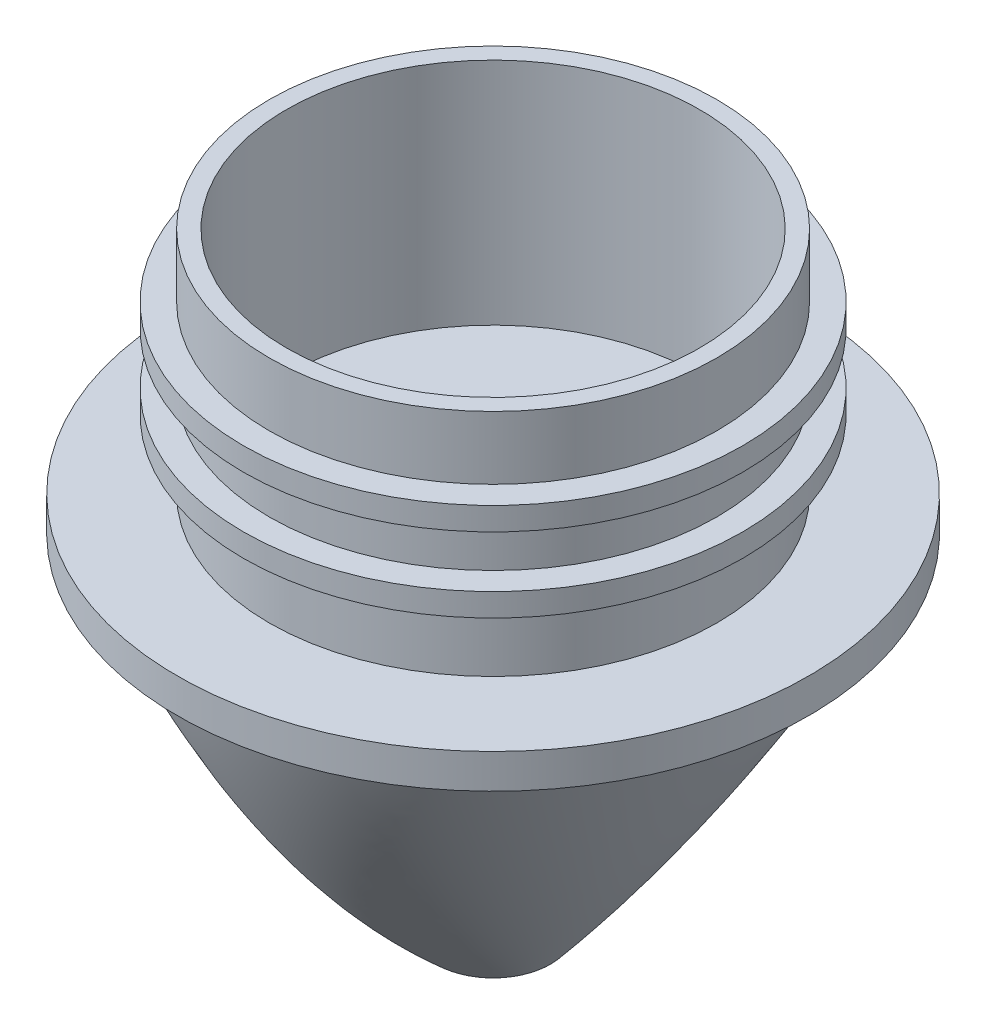
ISO-10303-21;
HEADER;
FILE_DESCRIPTION(('STEP AP214'),'2;1');
FILE_NAME('part.step','',(''),(''),'','','');
FILE_SCHEMA(('AUTOMOTIVE_DESIGN { 1 0 10303 214 1 1 1 1 }'));
ENDSEC;
DATA;
#1=APPLICATION_CONTEXT('core data for automotive mechanical design processes');
#2=APPLICATION_PROTOCOL_DEFINITION('international standard','automotive_design',2000,#1);
#3=PRODUCT_CONTEXT('',#1,'mechanical');
#4=PRODUCT('Part','Part','',(#3));
#5=PRODUCT_RELATED_PRODUCT_CATEGORY('part','',(#4));
#6=PRODUCT_DEFINITION_FORMATION('','',#4);
#7=PRODUCT_DEFINITION_CONTEXT('part definition',#1,'design');
#8=PRODUCT_DEFINITION('design','',#6,#7);
#9=PRODUCT_DEFINITION_SHAPE('','',#8);
#10=(LENGTH_UNIT() NAMED_UNIT(*) SI_UNIT(.MILLI.,.METRE.));
#11=(NAMED_UNIT(*) PLANE_ANGLE_UNIT() SI_UNIT($,.RADIAN.));
#12=(NAMED_UNIT(*) SI_UNIT($,.STERADIAN.) SOLID_ANGLE_UNIT());
#13=UNCERTAINTY_MEASURE_WITH_UNIT(LENGTH_MEASURE(1.E-05),#10,'distance_accuracy_value','');
#14=(GEOMETRIC_REPRESENTATION_CONTEXT(3) GLOBAL_UNCERTAINTY_ASSIGNED_CONTEXT((#13)) GLOBAL_UNIT_ASSIGNED_CONTEXT((#10,
#11,#12)) REPRESENTATION_CONTEXT('',''));
#15=CARTESIAN_POINT('',(0.,0.,0.));
#16=DIRECTION('',(0.,0.,1.));
#17=DIRECTION('',(1.,0.,0.));
#18=AXIS2_PLACEMENT_3D('',#15,#16,#17);
#19=CARTESIAN_POINT('',(0.,-23.4034123059416,-1.68146346259813));
#20=DIRECTION('',(-1.,0.,0.));
#21=DIRECTION('',(0.,0.,1.));
#22=AXIS2_PLACEMENT_3D('',#19,#20,#21);
#23=CIRCLE('',#22,11.6934361661484);
#24=TRIMMED_CURVE('',#23,(PARAMETER_VALUE(-1.42650061481023)),
(PARAMETER_VALUE(1.42650061481023)),.T.,.PARAMETER.);
#25=CARTESIAN_POINT('',(0.,-23.4034123059416,0.));
#26=DIRECTION('',(0.,1.,0.));
#27=AXIS1_PLACEMENT('',#25,#26);
#28=SURFACE_OF_REVOLUTION('',#24,#27);
#29=CARTESIAN_POINT('',(0.,-34.9753235567132,0.));
#30=VERTEX_POINT('',#29);
#31=VERTEX_LOOP('',#30);
#32=FACE_BOUND('',#31,.T.);
#33=CARTESIAN_POINT('',(0.,-33.,0.));
#34=DIRECTION('',(0.,1.,0.));
#35=DIRECTION('',(0.,0.,1.));
#36=AXIS2_PLACEMENT_3D('',#33,#34,#35);
#37=CIRCLE('',#36,5.);
#38=CARTESIAN_POINT('',(0.,-33.,5.));
#39=VERTEX_POINT('',#38);
#40=EDGE_CURVE('E14',#39,#39,#37,.T.);
#41=ORIENTED_EDGE('',*,*,#40,.F.);
#42=EDGE_LOOP('',(#41));
#43=FACE_BOUND('',#42,.T.);
#44=ADVANCED_FACE('F96',(#32,#43),#28,.T.);
#45=CARTESIAN_POINT('',(0.,-33.,5.));
#46=DIRECTION('',(0.,1.,0.));
#47=DIRECTION('',(0.,0.,1.));
#48=AXIS2_PLACEMENT_3D('',#45,#46,#47);
#49=PLANE('',#48);
#50=ORIENTED_EDGE('',*,*,#40,.T.);
#51=EDGE_LOOP('',(#50));
#52=FACE_BOUND('',#51,.T.);
#53=ADVANCED_FACE('F105',(#52),#49,.T.);
#54=CLOSED_SHELL('',(#44,#53));
#55=MANIFOLD_SOLID_BREP('B2',#54);
#56=CARTESIAN_POINT('',(0.,-33.,-5.));
#57=DIRECTION('',(0.,1.,-1.06741180562796E-13));
#58=DIRECTION('',(0.,1.06741180562796E-13,1.));
#59=AXIS2_PLACEMENT_3D('',#56,#57,#58);
#60=PLANE('',#59);
#61=CARTESIAN_POINT('',(0.,-33.,5.));
#62=CARTESIAN_POINT('',(-0.327249232137514,-33.,5.));
#63=CARTESIAN_POINT('',(-0.981680403977716,-33.,4.93499328124983));
#64=CARTESIAN_POINT('',(-2.24064053377986,-33.,4.55458579852169));
#65=CARTESIAN_POINT('',(-3.62771208725025,-32.9999999999999,3.62764916613364));
#66=CARTESIAN_POINT('',(-4.73979573179852,-33.,1.9633506312621));
#67=CARTESIAN_POINT('',(-5.13036592541444,-32.9999999999999,0.));
#68=CARTESIAN_POINT('',(-4.73979573179851,-33.0000000000001,-1.9633506312621));
#69=CARTESIAN_POINT('',(-3.62771208725026,-32.9999999999999,-3.62764916613364));
#70=CARTESIAN_POINT('',(-2.24064053377986,-33.,-4.55458579852169));
#71=CARTESIAN_POINT('',(-0.981680403977716,-33.,-4.93499328124983));
#72=CARTESIAN_POINT('',(-0.327249232137514,-33.,-5.));
#73=CARTESIAN_POINT('',(0.327249232137514,-33.,-5.));
#74=CARTESIAN_POINT('',(0.981680403977717,-33.,-4.93499328124983));
#75=CARTESIAN_POINT('',(2.24064053377986,-33.,-4.5545857985217));
#76=CARTESIAN_POINT('',(3.62771208725025,-32.9999999999999,-3.62764916613363));
#77=CARTESIAN_POINT('',(4.73979573179853,-33.,-1.9633506312621));
#78=CARTESIAN_POINT('',(5.13036592541442,-33.,0.));
#79=CARTESIAN_POINT('',(4.73979573179853,-33.,1.9633506312621));
#80=CARTESIAN_POINT('',(3.62771208725025,-33.,3.62764916613364));
#81=CARTESIAN_POINT('',(2.24064053377986,-33.,4.55458579852169));
#82=CARTESIAN_POINT('',(0.981680403977717,-33.,4.93499328124983));
#83=CARTESIAN_POINT('',(0.327249232137515,-33.,5.));
#84=CARTESIAN_POINT('',(0.,-33.,5.));
#85=B_SPLINE_CURVE_WITH_KNOTS('',3,(#61,#62,#63,#64,#65,#66,#67,#68,#69,#70,#71,#72,#73,#74,#75,
#76,#77,#78,#79,#80,#81,#82,#83,#84),.UNSPECIFIED.,.T.,.F.,(4,1,1,1,1,1,1,1,1,1,2,1,1,1,1,1,1,1,
1,1,4),(0.,0.03125,0.0625,0.125,0.1875,0.25,0.3125,0.375,0.4375,0.46875,0.5,0.53125,0.5625,
0.625,0.6875,0.75,0.8125,0.875,0.9375,0.96875,1.),.UNSPECIFIED.);
#86=CARTESIAN_POINT('',(0.,-33.,5.));
#87=VERTEX_POINT('',#86);
#88=EDGE_CURVE('E134',#87,#87,#85,.F.);
#89=ORIENTED_EDGE('',*,*,#88,.F.);
#90=EDGE_LOOP('',(#89));
#91=FACE_BOUND('',#90,.T.);
#92=ADVANCED_FACE('F131',(#91),#60,.F.);
#93=CARTESIAN_POINT('',(0.,-3.,-25.));
#94=DIRECTION('',(0.,1.,0.));
#95=DIRECTION('',(0.,0.,1.));
#96=AXIS2_PLACEMENT_3D('',#93,#94,#95);
#97=PLANE('',#96);
#98=CARTESIAN_POINT('',(0.,-3.,25.));
#99=CARTESIAN_POINT('',(-1.63624616068757,-3.,25.));
#100=CARTESIAN_POINT('',(-4.90813549192513,-3.,24.6765838751217));
#101=CARTESIAN_POINT('',(-11.2035179919908,-2.99999999999999,22.7715638139233));
#102=CARTESIAN_POINT('',(-18.1384091942729,-3.00000000000001,18.1389749409526));
#103=CARTESIAN_POINT('',(-23.6992576262852,-3.,9.81635374424561));
#104=CARTESIAN_POINT('',(-25.6515460302529,-2.99999999999999,0.));
#105=CARTESIAN_POINT('',(-23.6992576262853,-3.00000000000001,-9.81635374424557));
#106=CARTESIAN_POINT('',(-18.1384091942729,-3.,-18.1389749409527));
#107=CARTESIAN_POINT('',(-11.2035179919908,-3.,-22.7715638139232));
#108=CARTESIAN_POINT('',(-4.90813549192511,-3.,-24.6765838751217));
#109=CARTESIAN_POINT('',(-1.63624616068757,-3.,-25.));
#110=CARTESIAN_POINT('',(1.63624616068757,-3.,-25.));
#111=CARTESIAN_POINT('',(4.90813549192511,-3.,-24.6765838751217));
#112=CARTESIAN_POINT('',(11.2035179919908,-3.,-22.7715638139232));
#113=CARTESIAN_POINT('',(18.1384091942728,-3.,-18.1389749409527));
#114=CARTESIAN_POINT('',(23.6992576262853,-3.00000000000001,-9.81635374424558));
#115=CARTESIAN_POINT('',(25.6515460302528,-2.99999999999999,0.));
#116=CARTESIAN_POINT('',(23.6992576262852,-3.00000000000001,9.81635374424565));
#117=CARTESIAN_POINT('',(18.1384091942729,-3.,18.1389749409526));
#118=CARTESIAN_POINT('',(11.2035179919908,-3.00000000000001,22.7715638139233));
#119=CARTESIAN_POINT('',(4.90813549192513,-3.,24.6765838751217));
#120=CARTESIAN_POINT('',(1.63624616068757,-3.,25.));
#121=CARTESIAN_POINT('',(0.,-3.,25.));
#122=B_SPLINE_CURVE_WITH_KNOTS('',3,(#98,#99,#100,#101,#102,#103,#104,#105,#106,#107,#108,#109,
#110,#111,#112,#113,#114,#115,#116,#117,#118,#119,#120,#121),.UNSPECIFIED.,.T.,.F.,(4,1,1,1,1,1,
1,1,1,1,2,1,1,1,1,1,1,1,1,1,4),(0.,0.03125,0.0625,0.125,0.1875,0.25,0.3125,0.375,0.4375,0.46875,
0.5,0.53125,0.5625,0.625,0.6875,0.75,0.8125,0.875,0.9375,0.96875,1.),.UNSPECIFIED.);
#123=CARTESIAN_POINT('',(0.,-3.,25.));
#124=VERTEX_POINT('',#123);
#125=EDGE_CURVE('E95',#124,#124,#122,.T.);
#126=ORIENTED_EDGE('',*,*,#125,.F.);
#127=EDGE_LOOP('',(#126));
#128=FACE_BOUND('',#127,.T.);
#129=ADVANCED_FACE('F161',(#128),#97,.T.);
#130=CARTESIAN_POINT('',(0.,-3.,25.));
#131=CARTESIAN_POINT('',(0.,-14.5667957946294,21.0517209178654));
#132=CARTESIAN_POINT('',(0.,-24.9066670800951,14.1584733942216));
#133=CARTESIAN_POINT('',(0.,-33.,5.));
#134=CARTESIAN_POINT('',(-1.63624616068757,-3.,25.));
#135=CARTESIAN_POINT('',(-1.19991385117089,-14.5667957946294,21.0517209178654));
#136=CARTESIAN_POINT('',(-0.7635815416542,-24.9066670800951,14.1584733942216));
#137=CARTESIAN_POINT('',(-0.327249232137514,-33.,5.));
#138=CARTESIAN_POINT('',(-4.90813549192513,-3.,24.6765838751217));
#139=CARTESIAN_POINT('',(-3.59931712927599,-14.5667957946294,20.7719664556881));
#140=CARTESIAN_POINT('',(-2.29049876662685,-24.9066670800951,13.968395726644));
#141=CARTESIAN_POINT('',(-0.981680403977716,-33.,4.93499328124983));
#142=CARTESIAN_POINT('',(-11.2035179919908,-2.99999999999999,22.7715638139233));
#143=CARTESIAN_POINT('',(-8.21589217258713,-14.5667957946294,19.1415391542674));
#144=CARTESIAN_POINT('',(-5.2282663531835,-24.9066670800951,12.8656444104432));
#145=CARTESIAN_POINT('',(-2.24064053377986,-33.,4.55458579852169));
#146=CARTESIAN_POINT('',(-18.1384091942729,-3.00000000000001,18.1389749409526));
#147=CARTESIAN_POINT('',(-13.3015101585987,-14.5667957946294,15.2132326197204));
#148=CARTESIAN_POINT('',(-8.46461112292447,-24.906667080095,10.216809363052));
#149=CARTESIAN_POINT('',(-3.62771208725025,-32.9999999999999,3.62764916613364));
#150=CARTESIAN_POINT('',(-23.6992576262852,-3.,9.81635374424561));
#151=CARTESIAN_POINT('',(-17.3794369947897,-14.5667957946294,8.21808138411729));
#152=CARTESIAN_POINT('',(-11.0596163632941,-24.9066670800951,5.51544585842304));
#153=CARTESIAN_POINT('',(-4.73979573179852,-33.,1.9633506312621));
#154=CARTESIAN_POINT('',(-25.6515460302529,-2.99999999999999,0.));
#155=CARTESIAN_POINT('',(-18.8111526619734,-14.5667957946294,0.));
#156=CARTESIAN_POINT('',(-11.9707592936939,-24.906667080095,0.));
#157=CARTESIAN_POINT('',(-5.13036592541444,-32.9999999999999,0.));
#158=CARTESIAN_POINT('',(-23.6992576262853,-3.00000000000001,-9.81635374424557));
#159=CARTESIAN_POINT('',(-17.3794369947897,-14.5667957946295,-8.21808138411725));
#160=CARTESIAN_POINT('',(-11.0596163632941,-24.9066670800951,-5.51544585842303));
#161=CARTESIAN_POINT('',(-4.73979573179851,-33.0000000000001,-1.9633506312621));
#162=CARTESIAN_POINT('',(-18.1384091942729,-3.,-18.1389749409527));
#163=CARTESIAN_POINT('',(-13.3015101585987,-14.5667957946294,-15.2132326197204));
#164=CARTESIAN_POINT('',(-8.46461112292446,-24.906667080095,-10.2168093630521));
#165=CARTESIAN_POINT('',(-3.62771208725026,-32.9999999999999,-3.62764916613364));
#166=CARTESIAN_POINT('',(-11.2035179919908,-3.,-22.7715638139232));
#167=CARTESIAN_POINT('',(-8.21589217258715,-14.5667957946294,-19.1415391542674));
#168=CARTESIAN_POINT('',(-5.2282663531835,-24.9066670800951,-12.8656444104432));
#169=CARTESIAN_POINT('',(-2.24064053377986,-33.,-4.55458579852169));
#170=CARTESIAN_POINT('',(-4.90813549192511,-3.,-24.6765838751217));
#171=CARTESIAN_POINT('',(-3.59931712927598,-14.5667957946294,-20.7719664556881));
#172=CARTESIAN_POINT('',(-2.29049876662685,-24.9066670800951,-13.968395726644));
#173=CARTESIAN_POINT('',(-0.981680403977716,-33.,-4.93499328124983));
#174=CARTESIAN_POINT('',(-1.63624616068757,-3.,-25.));
#175=CARTESIAN_POINT('',(-1.19991385117089,-14.5667957946294,-21.0517209178653));
#176=CARTESIAN_POINT('',(-0.7635815416542,-24.9066670800951,-14.1584733942216));
#177=CARTESIAN_POINT('',(-0.327249232137514,-33.,-5.));
#178=CARTESIAN_POINT('',(1.63624616068757,-3.,-25.));
#179=CARTESIAN_POINT('',(1.19991385117089,-14.5667957946294,-21.0517209178653));
#180=CARTESIAN_POINT('',(0.7635815416542,-24.9066670800951,-14.1584733942216));
#181=CARTESIAN_POINT('',(0.327249232137514,-33.,-5.));
#182=CARTESIAN_POINT('',(4.90813549192511,-3.,-24.6765838751217));
#183=CARTESIAN_POINT('',(3.59931712927598,-14.5667957946294,-20.7719664556881));
#184=CARTESIAN_POINT('',(2.29049876662685,-24.9066670800951,-13.968395726644));
#185=CARTESIAN_POINT('',(0.981680403977717,-33.,-4.93499328124983));
#186=CARTESIAN_POINT('',(11.2035179919908,-3.,-22.7715638139232));
#187=CARTESIAN_POINT('',(8.21589217258716,-14.5667957946294,-19.1415391542674));
#188=CARTESIAN_POINT('',(5.22826635318351,-24.9066670800951,-12.8656444104432));
#189=CARTESIAN_POINT('',(2.24064053377986,-33.,-4.5545857985217));
#190=CARTESIAN_POINT('',(18.1384091942728,-3.,-18.1389749409527));
#191=CARTESIAN_POINT('',(13.3015101585986,-14.5667957946294,-15.2132326197204));
#192=CARTESIAN_POINT('',(8.46461112292443,-24.906667080095,-10.2168093630521));
#193=CARTESIAN_POINT('',(3.62771208725025,-32.9999999999999,-3.62764916613363));
#194=CARTESIAN_POINT('',(23.6992576262853,-3.00000000000001,-9.81635374424558));
#195=CARTESIAN_POINT('',(17.3794369947897,-14.5667957946294,-8.21808138411725));
#196=CARTESIAN_POINT('',(11.0596163632941,-24.9066670800951,-5.51544585842303));
#197=CARTESIAN_POINT('',(4.73979573179853,-33.,-1.9633506312621));
#198=CARTESIAN_POINT('',(25.6515460302528,-2.99999999999999,0.));
#199=CARTESIAN_POINT('',(18.8111526619734,-14.5667957946294,0.));
#200=CARTESIAN_POINT('',(11.9707592936939,-24.9066670800951,0.));
#201=CARTESIAN_POINT('',(5.13036592541442,-33.,0.));
#202=CARTESIAN_POINT('',(23.6992576262852,-3.00000000000001,9.81635374424565));
#203=CARTESIAN_POINT('',(17.3794369947897,-14.5667957946295,8.21808138411732));
#204=CARTESIAN_POINT('',(11.0596163632941,-24.9066670800951,5.51544585842305));
#205=CARTESIAN_POINT('',(4.73979573179853,-33.,1.9633506312621));
#206=CARTESIAN_POINT('',(18.1384091942729,-3.,18.1389749409526));
#207=CARTESIAN_POINT('',(13.3015101585987,-14.5667957946294,15.2132326197203));
#208=CARTESIAN_POINT('',(8.46461112292447,-24.9066670800951,10.216809363052));
#209=CARTESIAN_POINT('',(3.62771208725025,-33.,3.62764916613364));
#210=CARTESIAN_POINT('',(11.2035179919908,-3.00000000000001,22.7715638139233));
#211=CARTESIAN_POINT('',(8.21589217258715,-14.5667957946294,19.1415391542674));
#212=CARTESIAN_POINT('',(5.2282663531835,-24.9066670800951,12.8656444104432));
#213=CARTESIAN_POINT('',(2.24064053377986,-33.,4.55458579852169));
#214=CARTESIAN_POINT('',(4.90813549192513,-3.,24.6765838751217));
#215=CARTESIAN_POINT('',(3.59931712927599,-14.5667957946294,20.7719664556881));
#216=CARTESIAN_POINT('',(2.29049876662685,-24.9066670800951,13.968395726644));
#217=CARTESIAN_POINT('',(0.981680403977717,-33.,4.93499328124983));
#218=CARTESIAN_POINT('',(1.63624616068757,-3.,25.));
#219=CARTESIAN_POINT('',(1.19991385117089,-14.5667957946294,21.0517209178654));
#220=CARTESIAN_POINT('',(0.7635815416542,-24.9066670800951,14.1584733942216));
#221=CARTESIAN_POINT('',(0.327249232137515,-33.,5.));
#222=CARTESIAN_POINT('',(0.,-3.,25.));
#223=CARTESIAN_POINT('',(0.,-14.5667957946294,21.0517209178654));
#224=CARTESIAN_POINT('',(0.,-24.9066670800951,14.1584733942216));
#225=CARTESIAN_POINT('',(0.,-33.,5.));
#226=B_SPLINE_SURFACE_WITH_KNOTS('',3,3,((#130,#131,#132,#133),(#134,#135,#136,#137),(#138,#139,
#140,#141),(#142,#143,#144,#145),(#146,#147,#148,#149),(#150,#151,#152,#153),(#154,#155,#156,
#157),(#158,#159,#160,#161),(#162,#163,#164,#165),(#166,#167,#168,#169),(#170,#171,#172,#173),
(#174,#175,#176,#177),(#178,#179,#180,#181),(#182,#183,#184,#185),(#186,#187,#188,#189),(#190,
#191,#192,#193),(#194,#195,#196,#197),(#198,#199,#200,#201),(#202,#203,#204,#205),(#206,#207,
#208,#209),(#210,#211,#212,#213),(#214,#215,#216,#217),(#218,#219,#220,#221),(#222,#223,#224,
#225)),.UNSPECIFIED.,.T.,.F.,.F.,(4,1,1,1,1,1,1,1,1,1,2,1,1,1,1,1,1,1,1,1,4),(4,4),(0.,0.03125,
0.0625,0.125,0.1875,0.25,0.3125,0.375,0.4375,0.46875,0.5,0.53125,0.5625,0.625,0.6875,0.75,
0.8125,0.875,0.9375,0.96875,1.),(0.,1.),.UNSPECIFIED.);
#227=ORIENTED_EDGE('',*,*,#125,.T.);
#228=EDGE_LOOP('',(#227));
#229=FACE_BOUND('',#228,.T.);
#230=ORIENTED_EDGE('',*,*,#88,.T.);
#231=EDGE_LOOP('',(#230));
#232=FACE_BOUND('',#231,.T.);
#233=ADVANCED_FACE('F158',(#229,#232),#226,.T.);
#234=OPEN_SHELL('',(#92,#129,#233));
#235=SHELL_BASED_SURFACE_MODEL('B8',(#234));
#236=CARTESIAN_POINT('',(0.,0.,0.));
#237=DIRECTION('',(0.,-1.,0.));
#238=DIRECTION('',(0.,0.,-1.));
#239=AXIS2_PLACEMENT_3D('',#236,#237,#238);
#240=PLANE('',#239);
#241=CARTESIAN_POINT('',(0.,0.,0.));
#242=DIRECTION('',(0.,1.,0.));
#243=DIRECTION('',(0.,0.,1.));
#244=AXIS2_PLACEMENT_3D('',#241,#242,#243);
#245=CIRCLE('',#244,18.);
#246=CARTESIAN_POINT('',(0.,0.,18.));
#247=VERTEX_POINT('',#246);
#248=EDGE_CURVE('E254',#247,#247,#245,.T.);
#249=ORIENTED_EDGE('',*,*,#248,.T.);
#250=EDGE_LOOP('',(#249));
#251=FACE_BOUND('',#250,.T.);
#252=ADVANCED_FACE('F204',(#251),#240,.F.);
#253=CARTESIAN_POINT('',(0.,20.,0.));
#254=DIRECTION('',(0.,-1.,0.));
#255=DIRECTION('',(0.,0.,-1.));
#256=AXIS2_PLACEMENT_3D('',#253,#254,#255);
#257=CYLINDRICAL_SURFACE('',#256,19.5);
#258=CARTESIAN_POINT('',(0.,8.,0.));
#259=DIRECTION('',(0.,1.,0.));
#260=DIRECTION('',(0.,0.,1.));
#261=AXIS2_PLACEMENT_3D('',#258,#259,#260);
#262=CIRCLE('',#261,19.5);
#263=CARTESIAN_POINT('',(0.,8.,19.5));
#264=VERTEX_POINT('',#263);
#265=EDGE_CURVE('E235',#264,#264,#262,.T.);
#266=ORIENTED_EDGE('',*,*,#265,.T.);
#267=EDGE_LOOP('',(#266));
#268=FACE_BOUND('',#267,.T.);
#269=CARTESIAN_POINT('',(0.,12.5,0.));
#270=DIRECTION('',(0.,1.,0.));
#271=DIRECTION('',(0.,0.,1.));
#272=AXIS2_PLACEMENT_3D('',#269,#270,#271);
#273=CIRCLE('',#272,19.5);
#274=CARTESIAN_POINT('',(0.,12.5,19.5));
#275=VERTEX_POINT('',#274);
#276=EDGE_CURVE('E130',#275,#275,#273,.T.);
#277=ORIENTED_EDGE('',*,*,#276,.F.);
#278=EDGE_LOOP('',(#277));
#279=FACE_BOUND('',#278,.T.);
#280=ADVANCED_FACE('F267',(#268,#279),#257,.T.);
#281=CARTESIAN_POINT('',(0.,0.,0.));
#282=DIRECTION('',(0.,1.,0.));
#283=DIRECTION('',(0.,0.,1.));
#284=AXIS2_PLACEMENT_3D('',#281,#282,#283);
#285=CIRCLE('',#284,19.5);
#286=CARTESIAN_POINT('',(0.,0.,19.5));
#287=VERTEX_POINT('',#286);
#288=EDGE_CURVE('E208',#287,#287,#285,.T.);
#289=ORIENTED_EDGE('',*,*,#288,.T.);
#290=EDGE_LOOP('',(#289));
#291=FACE_BOUND('',#290,.T.);
#292=CARTESIAN_POINT('',(0.,6.,0.));
#293=DIRECTION('',(0.,1.,0.));
#294=DIRECTION('',(0.,0.,1.));
#295=AXIS2_PLACEMENT_3D('',#292,#293,#294);
#296=CIRCLE('',#295,19.5);
#297=CARTESIAN_POINT('',(0.,6.,19.5));
#298=VERTEX_POINT('',#297);
#299=EDGE_CURVE('E213',#298,#298,#296,.T.);
#300=ORIENTED_EDGE('',*,*,#299,.F.);
#301=EDGE_LOOP('',(#300));
#302=FACE_BOUND('',#301,.T.);
#303=ADVANCED_FACE('F268',(#291,#302),#257,.T.);
#304=CARTESIAN_POINT('',(0.,-3.,0.));
#305=DIRECTION('',(0.,1.,0.));
#306=DIRECTION('',(0.,0.,1.));
#307=AXIS2_PLACEMENT_3D('',#304,#305,#306);
#308=CYLINDRICAL_SURFACE('',#307,27.5);
#309=CARTESIAN_POINT('',(0.,-3.,0.));
#310=DIRECTION('',(0.,-1.,0.));
#311=DIRECTION('',(0.,0.,-1.));
#312=AXIS2_PLACEMENT_3D('',#309,#310,#311);
#313=CIRCLE('',#312,27.5);
#314=CARTESIAN_POINT('',(0.,-3.,-27.5));
#315=VERTEX_POINT('',#314);
#316=EDGE_CURVE('E243',#315,#315,#313,.T.);
#317=ORIENTED_EDGE('',*,*,#316,.F.);
#318=EDGE_LOOP('',(#317));
#319=FACE_BOUND('',#318,.T.);
#320=CARTESIAN_POINT('',(0.,0.,0.));
#321=DIRECTION('',(0.,-1.,0.));
#322=DIRECTION('',(0.,0.,-1.));
#323=AXIS2_PLACEMENT_3D('',#320,#321,#322);
#324=CIRCLE('',#323,27.5);
#325=CARTESIAN_POINT('',(0.,0.,-27.5));
#326=VERTEX_POINT('',#325);
#327=EDGE_CURVE('E241',#326,#326,#324,.T.);
#328=ORIENTED_EDGE('',*,*,#327,.T.);
#329=EDGE_LOOP('',(#328));
#330=FACE_BOUND('',#329,.T.);
#331=ADVANCED_FACE('F279',(#319,#330),#308,.T.);
#332=CARTESIAN_POINT('',(0.,-3.,0.));
#333=DIRECTION('',(0.,-1.,0.));
#334=DIRECTION('',(0.,0.,-1.));
#335=AXIS2_PLACEMENT_3D('',#332,#333,#334);
#336=PLANE('',#335);
#337=ORIENTED_EDGE('',*,*,#316,.T.);
#338=EDGE_LOOP('',(#337));
#339=FACE_BOUND('',#338,.T.);
#340=ADVANCED_FACE('F291',(#339),#336,.T.);
#341=ORIENTED_EDGE('',*,*,#288,.F.);
#342=EDGE_LOOP('',(#341));
#343=FACE_BOUND('',#342,.T.);
#344=ORIENTED_EDGE('',*,*,#327,.F.);
#345=EDGE_LOOP('',(#344));
#346=FACE_BOUND('',#345,.T.);
#347=ADVANCED_FACE('F284',(#343,#346),#240,.F.);
#348=CARTESIAN_POINT('',(0.,6.,0.));
#349=DIRECTION('',(0.,1.,0.));
#350=DIRECTION('',(0.,0.,1.));
#351=AXIS2_PLACEMENT_3D('',#348,#349,#350);
#352=CYLINDRICAL_SURFACE('',#351,21.75);
#353=CARTESIAN_POINT('',(0.,6.,0.));
#354=DIRECTION('',(0.,1.,0.));
#355=DIRECTION('',(0.,0.,1.));
#356=AXIS2_PLACEMENT_3D('',#353,#354,#355);
#357=CIRCLE('',#356,21.75);
#358=CARTESIAN_POINT('',(0.,6.,21.75));
#359=VERTEX_POINT('',#358);
#360=EDGE_CURVE('E231',#359,#359,#357,.T.);
#361=ORIENTED_EDGE('',*,*,#360,.T.);
#362=EDGE_LOOP('',(#361));
#363=FACE_BOUND('',#362,.T.);
#364=CARTESIAN_POINT('',(0.,8.,0.));
#365=DIRECTION('',(0.,1.,0.));
#366=DIRECTION('',(0.,0.,1.));
#367=AXIS2_PLACEMENT_3D('',#364,#365,#366);
#368=CIRCLE('',#367,21.75);
#369=CARTESIAN_POINT('',(0.,8.,21.75));
#370=VERTEX_POINT('',#369);
#371=EDGE_CURVE('E229',#370,#370,#368,.T.);
#372=ORIENTED_EDGE('',*,*,#371,.F.);
#373=EDGE_LOOP('',(#372));
#374=FACE_BOUND('',#373,.T.);
#375=ADVANCED_FACE('F290',(#363,#374),#352,.T.);
#376=CARTESIAN_POINT('',(0.,6.,0.));
#377=DIRECTION('',(0.,1.,0.));
#378=DIRECTION('',(0.,0.,1.));
#379=AXIS2_PLACEMENT_3D('',#376,#377,#378);
#380=PLANE('',#379);
#381=ORIENTED_EDGE('',*,*,#299,.T.);
#382=EDGE_LOOP('',(#381));
#383=FACE_BOUND('',#382,.T.);
#384=ORIENTED_EDGE('',*,*,#360,.F.);
#385=EDGE_LOOP('',(#384));
#386=FACE_BOUND('',#385,.T.);
#387=ADVANCED_FACE('F297',(#383,#386),#380,.F.);
#388=CARTESIAN_POINT('',(0.,8.,0.));
#389=DIRECTION('',(0.,1.,0.));
#390=DIRECTION('',(0.,0.,1.));
#391=AXIS2_PLACEMENT_3D('',#388,#389,#390);
#392=PLANE('',#391);
#393=ORIENTED_EDGE('',*,*,#265,.F.);
#394=EDGE_LOOP('',(#393));
#395=FACE_BOUND('',#394,.T.);
#396=ORIENTED_EDGE('',*,*,#371,.T.);
#397=EDGE_LOOP('',(#396));
#398=FACE_BOUND('',#397,.T.);
#399=ADVANCED_FACE('F364',(#395,#398),#392,.T.);
#400=CARTESIAN_POINT('',(0.,14.5,0.));
#401=DIRECTION('',(0.,-1.,0.));
#402=DIRECTION('',(0.,0.,-1.));
#403=AXIS2_PLACEMENT_3D('',#400,#401,#402);
#404=CYLINDRICAL_SURFACE('',#403,21.75);
#405=CARTESIAN_POINT('',(0.,14.5,0.));
#406=DIRECTION('',(0.,1.,0.));
#407=DIRECTION('',(0.,0.,1.));
#408=AXIS2_PLACEMENT_3D('',#405,#406,#407);
#409=CIRCLE('',#408,21.75);
#410=CARTESIAN_POINT('',(0.,14.5,21.75));
#411=VERTEX_POINT('',#410);
#412=EDGE_CURVE('E230',#411,#411,#409,.T.);
#413=ORIENTED_EDGE('',*,*,#412,.F.);
#414=EDGE_LOOP('',(#413));
#415=FACE_BOUND('',#414,.T.);
#416=CARTESIAN_POINT('',(0.,12.5,0.));
#417=DIRECTION('',(0.,1.,0.));
#418=DIRECTION('',(0.,0.,1.));
#419=AXIS2_PLACEMENT_3D('',#416,#417,#418);
#420=CIRCLE('',#419,21.75);
#421=CARTESIAN_POINT('',(0.,12.5,21.75));
#422=VERTEX_POINT('',#421);
#423=EDGE_CURVE('E223',#422,#422,#420,.T.);
#424=ORIENTED_EDGE('',*,*,#423,.T.);
#425=EDGE_LOOP('',(#424));
#426=FACE_BOUND('',#425,.T.);
#427=ADVANCED_FACE('F374',(#415,#426),#404,.T.);
#428=CARTESIAN_POINT('',(0.,14.5,0.));
#429=DIRECTION('',(0.,1.,0.));
#430=DIRECTION('',(0.,0.,1.));
#431=AXIS2_PLACEMENT_3D('',#428,#429,#430);
#432=PLANE('',#431);
#433=CARTESIAN_POINT('',(0.,14.5,0.));
#434=DIRECTION('',(0.,1.,0.));
#435=DIRECTION('',(0.,0.,1.));
#436=AXIS2_PLACEMENT_3D('',#433,#434,#435);
#437=CIRCLE('',#436,19.5);
#438=CARTESIAN_POINT('',(0.,14.5,19.5));
#439=VERTEX_POINT('',#438);
#440=EDGE_CURVE('E225',#439,#439,#437,.T.);
#441=ORIENTED_EDGE('',*,*,#440,.F.);
#442=EDGE_LOOP('',(#441));
#443=FACE_BOUND('',#442,.T.);
#444=ORIENTED_EDGE('',*,*,#412,.T.);
#445=EDGE_LOOP('',(#444));
#446=FACE_BOUND('',#445,.T.);
#447=ADVANCED_FACE('F274',(#443,#446),#432,.T.);
#448=CARTESIAN_POINT('',(0.,12.5,0.));
#449=DIRECTION('',(0.,1.,0.));
#450=DIRECTION('',(0.,0.,1.));
#451=AXIS2_PLACEMENT_3D('',#448,#449,#450);
#452=PLANE('',#451);
#453=ORIENTED_EDGE('',*,*,#276,.T.);
#454=EDGE_LOOP('',(#453));
#455=FACE_BOUND('',#454,.T.);
#456=ORIENTED_EDGE('',*,*,#423,.F.);
#457=EDGE_LOOP('',(#456));
#458=FACE_BOUND('',#457,.T.);
#459=ADVANCED_FACE('F265',(#455,#458),#452,.F.);
#460=ORIENTED_EDGE('',*,*,#440,.T.);
#461=EDGE_LOOP('',(#460));
#462=FACE_BOUND('',#461,.T.);
#463=CARTESIAN_POINT('',(0.,20.,0.));
#464=DIRECTION('',(0.,1.,0.));
#465=DIRECTION('',(0.,0.,1.));
#466=AXIS2_PLACEMENT_3D('',#463,#464,#465);
#467=CIRCLE('',#466,19.5);
#468=CARTESIAN_POINT('',(0.,20.,19.5));
#469=VERTEX_POINT('',#468);
#470=EDGE_CURVE('E219',#469,#469,#467,.T.);
#471=ORIENTED_EDGE('',*,*,#470,.F.);
#472=EDGE_LOOP('',(#471));
#473=FACE_BOUND('',#472,.T.);
#474=ADVANCED_FACE('F206',(#462,#473),#257,.T.);
#475=CARTESIAN_POINT('',(0.,20.,0.));
#476=DIRECTION('',(0.,1.,0.));
#477=DIRECTION('',(0.,0.,1.));
#478=AXIS2_PLACEMENT_3D('',#475,#476,#477);
#479=PLANE('',#478);
#480=ORIENTED_EDGE('',*,*,#470,.T.);
#481=EDGE_LOOP('',(#480));
#482=FACE_BOUND('',#481,.T.);
#483=CARTESIAN_POINT('',(0.,20.,0.));
#484=DIRECTION('',(0.,1.,0.));
#485=DIRECTION('',(0.,0.,1.));
#486=AXIS2_PLACEMENT_3D('',#483,#484,#485);
#487=CIRCLE('',#486,18.);
#488=CARTESIAN_POINT('',(0.,20.,18.));
#489=VERTEX_POINT('',#488);
#490=EDGE_CURVE('E250',#489,#489,#487,.T.);
#491=ORIENTED_EDGE('',*,*,#490,.F.);
#492=EDGE_LOOP('',(#491));
#493=FACE_BOUND('',#492,.T.);
#494=ADVANCED_FACE('F261',(#482,#493),#479,.T.);
#495=CARTESIAN_POINT('',(0.,20.,0.));
#496=DIRECTION('',(0.,-1.,0.));
#497=DIRECTION('',(0.,0.,-1.));
#498=AXIS2_PLACEMENT_3D('',#495,#496,#497);
#499=CYLINDRICAL_SURFACE('',#498,18.);
#500=ORIENTED_EDGE('',*,*,#490,.T.);
#501=EDGE_LOOP('',(#500));
#502=FACE_BOUND('',#501,.T.);
#503=ORIENTED_EDGE('',*,*,#248,.F.);
#504=EDGE_LOOP('',(#503));
#505=FACE_BOUND('',#504,.T.);
#506=ADVANCED_FACE('F273',(#502,#505),#499,.F.);
#507=CLOSED_SHELL('',(#252,#280,#303,#331,#340,#347,#375,#387,#399,#427,#447,#459,#474,#494,#506));
#508=MANIFOLD_SOLID_BREP('B90',#507);
#509=ADVANCED_BREP_SHAPE_REPRESENTATION('',(#18,#55,#508),#14);
#510=MANIFOLD_SURFACE_SHAPE_REPRESENTATION('',(#18,#235),#14);
#511=SHAPE_REPRESENTATION('',(#18),#14);
#512=SHAPE_DEFINITION_REPRESENTATION(#9,#511);
#513=SHAPE_REPRESENTATION_RELATIONSHIP('','',#511,#509);
#514=SHAPE_REPRESENTATION_RELATIONSHIP('','',#511,#510);
ENDSEC;
END-ISO-10303-21;
